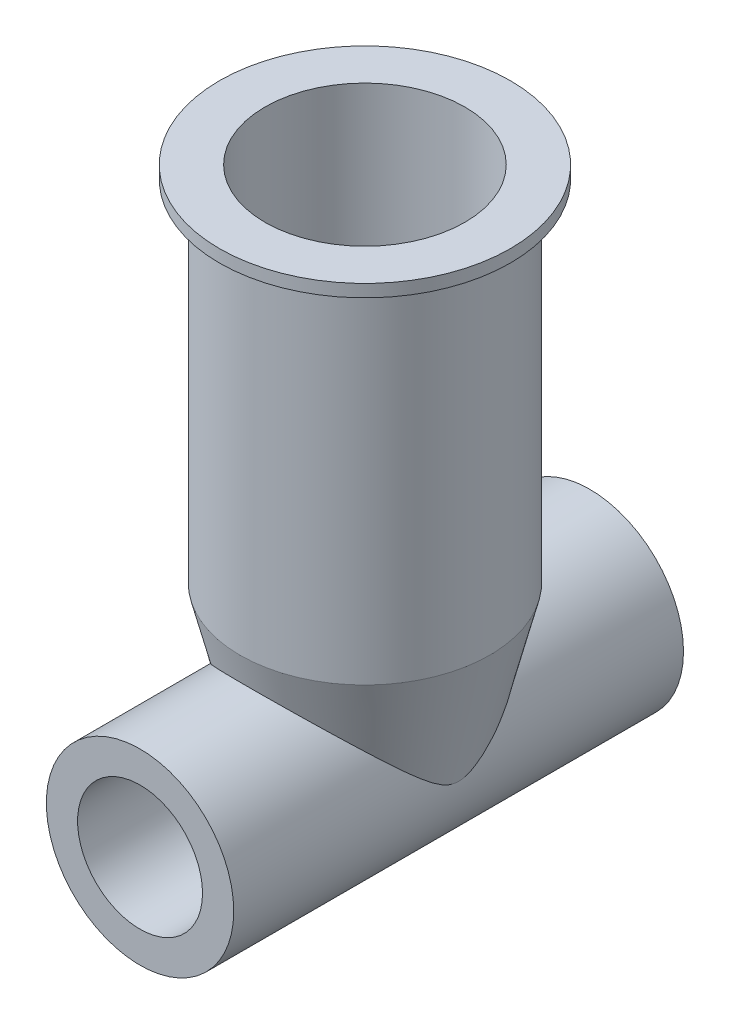
ISO-10303-21;
HEADER;
FILE_DESCRIPTION(('STEP AP214'),'2;1');
FILE_NAME('part.step','',(''),(''),'','','');
FILE_SCHEMA(('AUTOMOTIVE_DESIGN { 1 0 10303 214 1 1 1 1 }'));
ENDSEC;
DATA;
#1=APPLICATION_CONTEXT('core data for automotive mechanical design processes');
#2=APPLICATION_PROTOCOL_DEFINITION('international standard','automotive_design',2000,#1);
#3=PRODUCT_CONTEXT('',#1,'mechanical');
#4=PRODUCT('Part','Part','',(#3));
#5=PRODUCT_RELATED_PRODUCT_CATEGORY('part','',(#4));
#6=PRODUCT_DEFINITION_FORMATION('','',#4);
#7=PRODUCT_DEFINITION_CONTEXT('part definition',#1,'design');
#8=PRODUCT_DEFINITION('design','',#6,#7);
#9=PRODUCT_DEFINITION_SHAPE('','',#8);
#10=(LENGTH_UNIT() NAMED_UNIT(*) SI_UNIT(.MILLI.,.METRE.));
#11=(NAMED_UNIT(*) PLANE_ANGLE_UNIT() SI_UNIT($,.RADIAN.));
#12=(NAMED_UNIT(*) SI_UNIT($,.STERADIAN.) SOLID_ANGLE_UNIT());
#13=UNCERTAINTY_MEASURE_WITH_UNIT(LENGTH_MEASURE(1.E-05),#10,'distance_accuracy_value','');
#14=(GEOMETRIC_REPRESENTATION_CONTEXT(3) GLOBAL_UNCERTAINTY_ASSIGNED_CONTEXT((#13)) GLOBAL_UNIT_ASSIGNED_CONTEXT((#10,
#11,#12)) REPRESENTATION_CONTEXT('',''));
#15=CARTESIAN_POINT('',(0.,0.,0.));
#16=DIRECTION('',(0.,0.,1.));
#17=DIRECTION('',(1.,0.,0.));
#18=AXIS2_PLACEMENT_3D('',#15,#16,#17);
#19=CARTESIAN_POINT('',(0.,0.,-18.));
#20=DIRECTION('',(0.,0.,1.));
#21=DIRECTION('',(1.,0.,0.));
#22=AXIS2_PLACEMENT_3D('',#19,#20,#21);
#23=CYLINDRICAL_SURFACE('',#22,7.5);
#24=CARTESIAN_POINT('',(0.,0.,0.));
#25=DIRECTION('',(0.,1.,0.));
#26=DIRECTION('',(0.,0.,1.));
#27=AXIS2_PLACEMENT_3D('',#24,#25,#26);
#28=CIRCLE('',#27,7.5);
#29=CARTESIAN_POINT('',(7.5,7.9539344722326E-08,0.000546143343571179));
#30=VERTEX_POINT('',#29);
#31=CARTESIAN_POINT('',(7.5,0.,0.));
#32=VERTEX_POINT('',#31);
#33=EDGE_CURVE('E66',#30,#32,#28,.T.);
#34=ORIENTED_EDGE('',*,*,#33,.F.);
#35=CARTESIAN_POINT('',(-6.61320157659944,3.53773443142114,-5.15405586230843));
#36=CARTESIAN_POINT('',(-6.74809705513501,3.28556143948497,-4.8784253702715));
#37=CARTESIAN_POINT('',(-6.8660531232813,3.03036321266984,-4.59711082388532));
#38=CARTESIAN_POINT('',(-7.01894883888934,2.64639385705199,-4.16750919903163));
#39=CARTESIAN_POINT('',(-7.06593813689447,2.51809634764333,-4.02290759225156));
#40=CARTESIAN_POINT('',(-7.15209296283975,2.26181909678305,-3.73111922999439));
#41=CARTESIAN_POINT('',(-7.19125941511541,2.13383931955556,-3.58393278217669));
#42=CARTESIAN_POINT('',(-7.26190321000422,1.87940005449735,-3.28716729121952));
#43=CARTESIAN_POINT('',(-7.2934013995853,1.75293735392403,-3.13759594000608));
#44=CARTESIAN_POINT('',(-7.34911880374787,1.50230489314478,-2.83510919196657));
#45=CARTESIAN_POINT('',(-7.3733355415806,1.37813592658939,-2.68219267622999));
#46=CARTESIAN_POINT('',(-7.41475947365553,1.13428241571495,-2.37249809885837));
#47=CARTESIAN_POINT('',(-7.43198344577408,1.01458777073297,-2.21573024873793));
#48=CARTESIAN_POINT('',(-7.4599774546505,0.782493390251813,-1.89638027254089));
#49=CARTESIAN_POINT('',(-7.4707527208265,0.670087810008142,-1.73380297118948));
#50=CARTESIAN_POINT('',(-7.4818052886037,0.523718330581862,-1.50255840646446));
#51=CARTESIAN_POINT('',(-7.48446301403202,0.484034979380131,-1.43764071102675));
#52=CARTESIAN_POINT('',(-7.48903205995686,0.407281613949371,-1.30625661753596));
#53=CARTESIAN_POINT('',(-7.49094329907509,0.370211885005457,-1.23979005146906));
#54=CARTESIAN_POINT('',(-7.49568135899195,0.264035803329959,-1.03782910282829));
#55=CARTESIAN_POINT('',(-7.49752167839577,0.199830035216777,-0.89957242662149));
#56=CARTESIAN_POINT('',(-7.49938231082716,0.105091899765061,-0.645277813189461));
#57=CARTESIAN_POINT('',(-7.4997099464473,0.0702812965857011,-0.530893443775187));
#58=CARTESIAN_POINT('',(-7.50001725106025,0.0201826111539165,-0.29806703473363));
#59=CARTESIAN_POINT('',(-7.49999814567919,0.0048259708462501,-0.179640763532988));
#60=CARTESIAN_POINT('',(-7.50000173587526,-0.00287805927304035,0.0587550198297938));
#61=CARTESIAN_POINT('',(-7.5000246929406,0.00491867489089359,0.178729550434703));
#62=CARTESIAN_POINT('',(-7.49990239520932,0.0418470345207006,0.415465244548114));
#63=CARTESIAN_POINT('',(-7.49975664542932,0.0710413477875864,0.532215918110214));
#64=CARTESIAN_POINT('',(-7.4986816277319,0.145405075332991,0.761278245424615));
#65=CARTESIAN_POINT('',(-7.4977460600945,0.190701233909167,0.873546584416198));
#66=CARTESIAN_POINT('',(-7.4944843241405,0.292028629592736,1.09319345839956));
#67=CARTESIAN_POINT('',(-7.49215568678609,0.348078806721073,1.20056294628575));
#68=CARTESIAN_POINT('',(-7.48564376072543,0.467717745065244,1.41202078729599));
#69=CARTESIAN_POINT('',(-7.4814457679568,0.531363285789262,1.51607597599339));
#70=CARTESIAN_POINT('',(-7.47089404107053,0.663431366597112,1.72085390612633));
#71=CARTESIAN_POINT('',(-7.46454181817174,0.731850531273435,1.82157892949855));
#72=CARTESIAN_POINT('',(-7.44518393231739,0.91182113662772,2.07708963955048));
#73=CARTESIAN_POINT('',(-7.43044886572856,1.02577539036855,2.23004594777763));
#74=CARTESIAN_POINT('',(-7.3946280157267,1.25832081989527,2.53166440412867));
#75=CARTESIAN_POINT('',(-7.37353986735014,1.37691370810363,2.6803249305044));
#76=CARTESIAN_POINT('',(-7.32465150363509,1.61694174044912,2.97452117375761));
#77=CARTESIAN_POINT('',(-7.29684298051375,1.73838023323266,3.1200527782437));
#78=CARTESIAN_POINT('',(-7.23427470816608,1.98272427248463,3.40837093600875));
#79=CARTESIAN_POINT('',(-7.19951423734498,2.10562996999893,3.55115720264068));
#80=CARTESIAN_POINT('',(-7.08470334690888,2.4744911954719,3.97503506055283));
#81=CARTESIAN_POINT('',(-6.9939756311839,2.72134176320794,4.25254668889251));
#82=CARTESIAN_POINT('',(-6.78249998735241,3.21235180731754,4.79797630725139));
#83=CARTESIAN_POINT('',(-6.66177690617969,3.45651333722966,5.06590202874486));
#84=CARTESIAN_POINT('',(-6.42386288123573,3.87636784824739,5.523193971319));
#85=CARTESIAN_POINT('',(-6.31380220548549,4.05346771888293,5.71498849519644));
#86=CARTESIAN_POINT('',(-6.0754112695079,4.40273648235033,6.09171014745804));
#87=CARTESIAN_POINT('',(-5.947078996211,4.57490482933867,6.27663651631027));
#88=CARTESIAN_POINT('',(-5.67148485930783,4.912401108886,6.63805780408488));
#89=CARTESIAN_POINT('',(-5.52424194898409,5.07773567425567,6.81456092555652));
#90=CARTESIAN_POINT('',(-5.20993787515479,5.3997346081586,7.15753616509969));
#91=CARTESIAN_POINT('',(-5.04288385713021,5.5564020730277,7.32401186739506));
#92=CARTESIAN_POINT('',(-4.73775189297959,5.81652150009949,7.59994180501488));
#93=CARTESIAN_POINT('',(-4.60459149277175,5.9226263841102,7.71234738941338));
#94=CARTESIAN_POINT('',(-4.32736984992019,6.12810249724339,7.92980039607749));
#95=CARTESIAN_POINT('',(-4.18330572383073,6.22747193194216,8.03484585774634));
#96=CARTESIAN_POINT('',(-3.88442784786883,6.41814687652538,8.2362418687826));
#97=CARTESIAN_POINT('',(-3.72962546197995,6.50946068571808,8.33260136914614));
#98=CARTESIAN_POINT('',(-3.40937845998663,6.68275759008583,8.51534877456879));
#99=CARTESIAN_POINT('',(-3.2439407708331,6.76474666414716,8.60174306968464));
#100=CARTESIAN_POINT('',(-2.93667571655216,6.90278245883528,8.74711614841249));
#101=CARTESIAN_POINT('',(-2.79667304984499,6.96074932269721,8.80813396905946));
#102=CARTESIAN_POINT('',(-2.51056843655749,7.06897582850668,8.92201551398301));
#103=CARTESIAN_POINT('',(-2.36446953402664,7.11923925979972,8.97488324739163));
#104=CARTESIAN_POINT('',(-2.0667700695,7.21129163012331,9.07167749082905));
#105=CARTESIAN_POINT('',(-1.91517091517014,7.25308271967268,9.11560626982669));
#106=CARTESIAN_POINT('',(-1.60727000317382,7.3274663089743,9.19377802662676));
#107=CARTESIAN_POINT('',(-1.45096820010294,7.36005871988108,9.22802091087796));
#108=CARTESIAN_POINT('',(-1.13367242697758,7.41558454546461,9.28635014287708));
#109=CARTESIAN_POINT('',(-0.972654190443076,7.43845238057259,9.31036753426766));
#110=CARTESIAN_POINT('',(-0.648212333756121,7.47371686842531,9.34740190798296));
#111=CARTESIAN_POINT('',(-0.484788707991197,7.48611349673372,9.36041886463631));
#112=CARTESIAN_POINT('',(-0.157016478848424,7.50014975035415,9.37515734345321));
#113=CARTESIAN_POINT('',(0.00733184862007326,7.50179243002074,9.37688207285416));
#114=CARTESIAN_POINT('',(0.335500621563336,7.49428925480907,9.36900367983671));
#115=CARTESIAN_POINT('',(0.499321105595518,7.48514420671922,9.35940140453796));
#116=CARTESIAN_POINT('',(0.807899599863817,7.45779608755527,9.33068242408866));
#117=CARTESIAN_POINT('',(0.952856240911138,7.44064264395448,9.31266819487775));
#118=CARTESIAN_POINT('',(1.24027342435016,7.39816398840857,9.26805080109966));
#119=CARTESIAN_POINT('',(1.3827331317569,7.37283609586017,9.24144481908338));
#120=CARTESIAN_POINT('',(1.66421544718924,7.31444085938264,9.18008980881214));
#121=CARTESIAN_POINT('',(1.80323902981614,7.28137573850357,9.14534311953073));
#122=CARTESIAN_POINT('',(2.07724086407488,7.20799539344709,9.06821025499059));
#123=CARTESIAN_POINT('',(2.21221749632084,7.16767731100473,9.02582106794282));
#124=CARTESIAN_POINT('',(2.48475606397905,7.07797105048914,8.93147595233143));
#125=CARTESIAN_POINT('',(2.62205734792646,7.02820806198673,8.87912428364017));
#126=CARTESIAN_POINT('',(2.89102789612641,6.92191348233042,8.76725412320456));
#127=CARTESIAN_POINT('',(3.02269531866239,6.86537970039556,8.70773331175231));
#128=CARTESIAN_POINT('',(3.40867582271751,6.68665050855163,8.51946933399201));
#129=CARTESIAN_POINT('',(3.65405726107538,6.5552968910782,8.38099271716159));
#130=CARTESIAN_POINT('',(4.25474428543344,6.19130494165446,7.99675078622709));
#131=CARTESIAN_POINT('',(4.59127523167133,5.94410425085349,7.73533677768344));
#132=CARTESIAN_POINT('',(5.04963410087188,5.54906777556111,7.31619840867083));
#133=CARTESIAN_POINT('',(5.1949018914058,5.41308088302144,7.17169590939528));
#134=CARTESIAN_POINT('',(5.47047380646926,5.13441935288831,6.87498067520199));
#135=CARTESIAN_POINT('',(5.60077831667004,4.9917448877973,6.72276813915249));
#136=CARTESIAN_POINT('',(5.89762444833259,4.64116340296421,6.34779408726627));
#137=CARTESIAN_POINT('',(6.05696666341839,4.43060656862025,6.12181180216102));
#138=CARTESIAN_POINT('',(6.34830614170618,4.00202093621475,5.65945461340801));
#139=CARTESIAN_POINT('',(6.480289995191,3.78398853472905,5.42307468183144));
#140=CARTESIAN_POINT('',(6.71813841520673,3.3435276940099,4.94191215860279));
#141=CARTESIAN_POINT('',(6.82402470107441,3.1211030778081,4.6971367485779));
#142=CARTESIAN_POINT('',(7.01104407066185,2.67466021036397,4.19997099780755));
#143=CARTESIAN_POINT('',(7.09218721923862,2.45064264513986,3.94758379937051));
#144=CARTESIAN_POINT('',(7.2292617228321,2.0098664487858,3.44115496423444));
#145=CARTESIAN_POINT('',(7.28576305407534,1.7930646147689,3.18730601331283));
#146=CARTESIAN_POINT('',(7.35468733078022,1.4732734417243,2.79919745637144));
#147=CARTESIAN_POINT('',(7.37502874408378,1.36754007947056,2.66855556850512));
#148=CARTESIAN_POINT('',(7.41064130490838,1.15911012714994,2.40419864939725));
#149=CARTESIAN_POINT('',(7.42591328932815,1.05641303838519,2.27048412930954));
#150=CARTESIAN_POINT('',(7.44799937990368,0.884604107371846,2.03779893199928));
#151=CARTESIAN_POINT('',(7.45598324564902,0.814287670863766,1.93982978289773));
#152=CARTESIAN_POINT('',(7.46967523172035,0.677261543587757,1.74125471533403));
#153=CARTESIAN_POINT('',(7.47538382778066,0.61055110136948,1.64064935276901));
#154=CARTESIAN_POINT('',(7.4847429524897,0.482429564495188,1.43613868618992));
#155=CARTESIAN_POINT('',(7.48839573142874,0.421012738094866,1.33223712235182));
#156=CARTESIAN_POINT('',(7.4939744987758,0.306023918371719,1.12018894327783));
#157=CARTESIAN_POINT('',(7.49590223226956,0.252444043074283,1.01204673385082));
#158=CARTESIAN_POINT('',(7.4985404667777,0.155832272538358,0.787727052841384));
#159=CARTESIAN_POINT('',(7.49921930359724,0.113097851706791,0.671416231520167));
#160=CARTESIAN_POINT('',(7.49993498962478,0.0461821634360362,0.43382452238483));
#161=CARTESIAN_POINT('',(7.49997469760318,0.0219187415643125,0.312568199804991));
#162=CARTESIAN_POINT('',(7.50001323970137,-0.00286317138587129,0.065983679835985));
#163=CARTESIAN_POINT('',(7.50001158064303,-0.00309498939990635,-0.0593758344507875));
#164=CARTESIAN_POINT('',(7.4999776970929,0.0210248800977522,-0.307797707649985));
#165=CARTESIAN_POINT('',(7.4999453975218,0.045436962679633,-0.430853666623425));
#166=CARTESIAN_POINT('',(7.49906246233558,0.127428640151383,-0.722762457647414));
#167=CARTESIAN_POINT('',(7.49786843698408,0.194717384946164,-0.888745172879665));
#168=CARTESIAN_POINT('',(7.49363127375126,0.31156882529719,-1.12975893510011));
#169=CARTESIAN_POINT('',(7.49180152143674,0.353329481331196,-1.20900734842534));
#170=CARTESIAN_POINT('',(7.48715840158507,0.440874289748779,-1.36523242116752));
#171=CARTESIAN_POINT('',(7.48434530198961,0.486657343571108,-1.44220969323361));
#172=CARTESIAN_POINT('',(7.47482610581218,0.619995511502793,-1.65673994042623));
#173=CARTESIAN_POINT('',(7.46682053112449,0.710961587882499,-1.79209196554467));
#174=CARTESIAN_POINT('',(7.44655584148733,0.898760504912508,-2.05837179288817));
#175=CARTESIAN_POINT('',(7.43429434116563,0.995596610437243,-2.18929706874104));
#176=CARTESIAN_POINT('',(7.40516786736286,1.1930928136378,-2.44804372794407));
#177=CARTESIAN_POINT('',(7.388295242061,1.29375902594607,-2.5758595640403));
#178=CARTESIAN_POINT('',(7.34972874138128,1.49741440064896,-2.82889439392082));
#179=CARTESIAN_POINT('',(7.3280342601001,1.60040385351401,-2.95411305918674));
#180=CARTESIAN_POINT('',(7.25538207138687,1.91175845045548,-3.32694299807635));
#181=CARTESIAN_POINT('',(7.1968946544851,2.12223221364878,-3.57137491384953));
#182=CARTESIAN_POINT('',(7.05884692043525,2.54401166812226,-4.05302840825562));
#183=CARTESIAN_POINT('',(6.97930624824294,2.75531640386851,-4.29025647999982));
#184=CARTESIAN_POINT('',(6.7981828670867,3.17602355428345,-4.75765173133414));
#185=CARTESIAN_POINT('',(6.69661404805207,3.38542708146919,-4.98782325654145));
#186=CARTESIAN_POINT('',(6.4702982035219,3.80014330549305,-5.44056233390496));
#187=CARTESIAN_POINT('',(6.34554246290292,4.00545443191195,-5.6631269895528));
#188=CARTESIAN_POINT('',(6.07200197259719,4.40909193196314,-6.09863202905522));
#189=CARTESIAN_POINT('',(5.92327261958574,4.60743315419886,-6.31159318597011));
#190=CARTESIAN_POINT('',(5.60044693545729,4.99485238730104,-6.72618930107918));
#191=CARTESIAN_POINT('',(5.42636500061718,5.18393557439158,-6.92783059773711));
#192=CARTESIAN_POINT('',(4.99589107093401,5.60414145108378,-7.37487204782033));
#193=CARTESIAN_POINT('',(4.73038913562713,5.83113615513201,-7.61555244722222));
#194=CARTESIAN_POINT('',(4.15272549169959,6.25564484566077,-8.06474648798324));
#195=CARTESIAN_POINT('',(3.84062459310654,6.4531965926048,-8.27330134193865));
#196=CARTESIAN_POINT('',(3.23355518701435,6.77409561537892,-8.61163533329006));
#197=CARTESIAN_POINT('',(2.94653184972578,6.90441060575172,-8.74885324872024));
#198=CARTESIAN_POINT('',(2.49582843913602,7.07437011379257,-8.9276907298525));
#199=CARTESIAN_POINT('',(2.3421840080253,7.12678287648573,-8.98281733347559));
#200=CARTESIAN_POINT('',(2.02889118002014,7.22221366464538,-9.08315986550921));
#201=CARTESIAN_POINT('',(1.86924562083046,7.26523606654736,-9.12838041073518));
#202=CARTESIAN_POINT('',(1.54345029081211,7.34138944652658,-9.20840759961474));
#203=CARTESIAN_POINT('',(1.37725513467864,7.37442856523832,-9.24311753771449));
#204=CARTESIAN_POINT('',(1.04100943451957,7.42935461587368,-9.30081327835943));
#205=CARTESIAN_POINT('',(0.870958873080595,7.45124149741644,-9.32379902793994));
#206=CARTESIAN_POINT('',(0.528655012503762,7.48331845690636,-9.35748433992442));
#207=CARTESIAN_POINT('',(0.356403191369269,7.49351600508613,-9.36819174897593));
#208=CARTESIAN_POINT('',(0.0112942944847741,7.50197660308043,-9.37707546792193));
#209=CARTESIAN_POINT('',(-0.161562701673201,7.50024116742709,-9.37525336805939));
#210=CARTESIAN_POINT('',(-0.482402912829425,7.48594803255162,-9.36024509177485));
#211=CARTESIAN_POINT('',(-0.630533796397303,7.47491339525391,-9.34865822469375));
#212=CARTESIAN_POINT('',(-0.924951572246102,7.44421745300976,-9.31642215844064));
#213=CARTESIAN_POINT('',(-1.07123786110365,7.42455339676253,-9.29577006902096));
#214=CARTESIAN_POINT('',(-1.36088539666958,7.37695924425815,-9.24577570804026));
#215=CARTESIAN_POINT('',(-1.50424767165405,7.34903210935145,-9.21643654977803));
#216=CARTESIAN_POINT('',(-1.78732027656718,7.28536505788948,-9.14953491869948));
#217=CARTESIAN_POINT('',(-1.92702912207055,7.24962201922286,-9.11196915970748));
#218=CARTESIAN_POINT('',(-2.20459002851406,7.17014670742452,-9.02841682667735));
#219=CARTESIAN_POINT('',(-2.34236029572798,7.12627922009478,-8.98228769733907));
#220=CARTESIAN_POINT('',(-2.61281041958519,7.03162610491209,-8.88271904290482));
#221=CARTESIAN_POINT('',(-2.74548864997567,6.98083829008255,-8.8292772068091));
#222=CARTESIAN_POINT('',(-3.13523132435222,6.81904825860703,-8.65896042048274));
#223=CARTESIAN_POINT('',(-3.3840624469812,6.69860223555828,-8.53207610298698));
#224=CARTESIAN_POINT('',(-3.9855987991564,6.36697845346649,-8.18231448225325));
#225=CARTESIAN_POINT('',(-4.32202264213911,6.14188335962317,-7.94455427446802));
#226=CARTESIAN_POINT('',(-4.78373083543405,5.77965473942041,-7.56086978248833));
#227=CARTESIAN_POINT('',(-4.93063258837747,5.65464584026388,-7.42828843060904));
#228=CARTESIAN_POINT('',(-5.21061060828153,5.39773790460035,-7.15535870176559));
#229=CARTESIAN_POINT('',(-5.34368887123174,5.26583986696872,-7.01501145062646));
#230=CARTESIAN_POINT('',(-5.58756100729743,5.00586587970365,-6.73780588564317));
#231=CARTESIAN_POINT('',(-5.69926169096202,4.87816467316271,-6.60138662092604));
#232=CARTESIAN_POINT('',(-5.91140265689726,4.61880712852137,-6.32365850486234));
#233=CARTESIAN_POINT('',(-6.01184309898232,4.48715084658821,-6.18234972294899));
#234=CARTESIAN_POINT('',(-6.2019049592746,4.2205674757013,-5.89536811658318));
#235=CARTESIAN_POINT('',(-6.29151802426664,4.08563795662716,-5.74969202957656));
#236=CARTESIAN_POINT('',(-6.46018513597841,3.81335353158669,-5.45459874933216));
#237=CARTESIAN_POINT('',(-6.5392395482,3.67599870976192,-5.305181685806));
#238=CARTESIAN_POINT('',(-6.61320157659944,3.53773443142114,-5.15405586230843));
#239=B_SPLINE_CURVE_WITH_KNOTS('',3,(#35,#36,#37,#38,#39,#40,#41,#42,#43,#44,#45,#46,#47,#48,
#49,#50,#51,#52,#53,#54,#55,#56,#57,#58,#59,#60,#61,#62,#63,#64,#65,#66,#67,#68,#69,#70,#71,#72,
#73,#74,#75,#76,#77,#78,#79,#80,#81,#82,#83,#84,#85,#86,#87,#88,#89,#90,#91,#92,#93,#94,#95,#96,
#97,#98,#99,#100,#101,#102,#103,#104,#105,#106,#107,#108,#109,#110,#111,#112,#113,#114,#115,
#116,#117,#118,#119,#120,#121,#122,#123,#124,#125,#126,#127,#128,#129,#130,#131,#132,#133,#134,
#135,#136,#137,#138,#139,#140,#141,#142,#143,#144,#145,#146,#147,#148,#149,#150,#151,#152,#153,
#154,#155,#156,#157,#158,#159,#160,#161,#162,#163,#164,#165,#166,#167,#168,#169,#170,#171,#172,
#173,#174,#175,#176,#177,#178,#179,#180,#181,#182,#183,#184,#185,#186,#187,#188,#189,#190,#191,
#192,#193,#194,#195,#196,#197,#198,#199,#200,#201,#202,#203,#204,#205,#206,#207,#208,#209,#210,
#211,#212,#213,#214,#215,#216,#217,#218,#219,#220,#221,#222,#223,#224,#225,#226,#227,#228,#229,
#230,#231,#232,#233,#234,#235,#236,#237,#238),.UNSPECIFIED.,.T.,.F.,(4,2,2,2,2,2,2,2,2,2,2,2,2,
2,2,2,2,2,2,2,2,2,2,2,2,2,2,2,2,2,2,2,2,2,2,2,2,2,2,2,2,2,2,2,2,2,2,2,2,2,2,2,2,2,2,2,2,2,2,2,2,
2,2,2,2,2,2,2,2,2,2,2,2,2,2,2,2,2,2,2,2,2,2,2,2,2,2,2,2,2,2,2,2,2,2,2,2,2,2,2,2,4),(0.,
1.19132542337807,1.78802969955181,2.38466342829518,2.9796565649532,3.57485185714447,
4.16861052417499,4.76188704261482,4.99022332808864,5.21858449872602,5.6745860600396,
6.03206318323956,6.38827697818143,6.74671275345619,7.10620284532076,7.46858768098818,
7.83161670821645,8.19755314064189,8.56323339337683,9.13685921363278,9.71069883311201,
10.2852514996431,10.8598638342832,12.0055519277651,13.1502941257752,13.9995808747269,
14.8489612661851,15.6974969098626,16.5457274287751,17.1573251621411,17.7690851989526,
18.3802074243842,18.9909355711981,19.4805397868239,19.9699023860423,20.4591406153065,
20.948383569718,21.4408754293037,21.9333684381991,22.425721562331,22.9180378668822,
23.3587636288949,23.7996340628424,24.2403779816863,24.681295971996,25.1462671082186,
25.611389100617,26.5413349663039,28.0105660168285,28.7478613950645,29.4851377656043,
30.5262827417764,31.5679368353292,32.6087210771431,33.649081388819,34.6639041936765,
35.171692638479,35.6793972120773,36.0418866711431,36.4043002977675,36.7663164522948,
37.1279659696699,37.498664584606,37.86770463222,38.2411464590213,38.6155057108351,
39.1496450636167,39.4184154027251,39.6871125645211,40.1766049183435,40.6663720683119,
41.1569569379932,41.6476034883259,42.6302467473848,43.6119763072056,44.5930886243343,
45.5745704545288,46.5538160222271,47.532507685105,48.8009615964655,50.0677744575897,
51.0947250396428,51.608505162112,52.1220453204657,52.6401761198827,53.1583092599639,
53.6761110948602,54.1938472116559,54.6402942662682,55.0868837642538,55.5333134054261,
55.9799217025228,56.4347685730418,56.8897595200585,57.799551896325,59.1996053471934,
59.9013544338511,60.6030020528919,61.2557270079069,61.9084426977506,62.5616587787785,
63.2148522419947),.UNSPECIFIED.);
#240=CARTESIAN_POINT('',(-7.5,0.,0.));
#241=VERTEX_POINT('',#240);
#242=EDGE_CURVE('E71',#241,#30,#239,.T.);
#243=ORIENTED_EDGE('',*,*,#242,.F.);
#244=CARTESIAN_POINT('',(-7.50000000006988,0.,-0.000546147915184217));
#245=VERTEX_POINT('',#244);
#246=EDGE_CURVE('E112',#245,#241,#28,.T.);
#247=ORIENTED_EDGE('',*,*,#246,.F.);
#248=EDGE_CURVE('E186',#32,#245,#239,.T.);
#249=ORIENTED_EDGE('',*,*,#248,.F.);
#250=EDGE_LOOP('',(#34,#243,#247,#249));
#251=FACE_BOUND('',#250,.T.);
#252=CARTESIAN_POINT('',(0.,0.,-18.));
#253=DIRECTION('',(0.,0.,1.));
#254=DIRECTION('',(1.,0.,0.));
#255=AXIS2_PLACEMENT_3D('',#252,#253,#254);
#256=CIRCLE('',#255,7.5);
#257=CARTESIAN_POINT('',(7.5,0.,-18.));
#258=VERTEX_POINT('',#257);
#259=EDGE_CURVE('E169',#258,#258,#256,.T.);
#260=ORIENTED_EDGE('',*,*,#259,.T.);
#261=EDGE_LOOP('',(#260));
#262=FACE_BOUND('',#261,.T.);
#263=CARTESIAN_POINT('',(0.,0.,18.));
#264=DIRECTION('',(0.,0.,1.));
#265=DIRECTION('',(1.,0.,0.));
#266=AXIS2_PLACEMENT_3D('',#263,#264,#265);
#267=CIRCLE('',#266,7.5);
#268=CARTESIAN_POINT('',(7.5,0.,18.));
#269=VERTEX_POINT('',#268);
#270=EDGE_CURVE('E177',#269,#269,#267,.T.);
#271=ORIENTED_EDGE('',*,*,#270,.F.);
#272=EDGE_LOOP('',(#271));
#273=FACE_BOUND('',#272,.T.);
#274=ADVANCED_FACE('F47',(#251,#262,#273),#23,.T.);
#275=CARTESIAN_POINT('',(0.,0.,-18.));
#276=DIRECTION('',(0.,0.,1.));
#277=DIRECTION('',(1.,0.,0.));
#278=AXIS2_PLACEMENT_3D('',#275,#276,#277);
#279=PLANE('',#278);
#280=CARTESIAN_POINT('',(0.,0.,-18.));
#281=DIRECTION('',(0.,0.,1.));
#282=DIRECTION('',(1.,0.,0.));
#283=AXIS2_PLACEMENT_3D('',#280,#281,#282);
#284=CIRCLE('',#283,5.);
#285=CARTESIAN_POINT('',(5.,0.,-18.));
#286=VERTEX_POINT('',#285);
#287=EDGE_CURVE('E173',#286,#286,#284,.T.);
#288=ORIENTED_EDGE('',*,*,#287,.T.);
#289=EDGE_LOOP('',(#288));
#290=FACE_BOUND('',#289,.T.);
#291=ORIENTED_EDGE('',*,*,#259,.F.);
#292=EDGE_LOOP('',(#291));
#293=FACE_BOUND('',#292,.T.);
#294=ADVANCED_FACE('F250',(#290,#293),#279,.F.);
#295=CARTESIAN_POINT('',(0.,0.,-18.));
#296=DIRECTION('',(0.,0.,1.));
#297=DIRECTION('',(1.,0.,0.));
#298=AXIS2_PLACEMENT_3D('',#295,#296,#297);
#299=CYLINDRICAL_SURFACE('',#298,5.);
#300=DIRECTION('',(0.,0.,1.));
#301=VECTOR('',#300,1.);
#302=CARTESIAN_POINT('',(-5.,0.,-18.));
#303=LINE('',#302,#301);
#304=CARTESIAN_POINT('',(-4.99999912611511,0.,5.59016896676148));
#305=VERTEX_POINT('',#304);
#306=CARTESIAN_POINT('',(-5.,0.,-5.59016994374948));
#307=VERTEX_POINT('',#306);
#308=EDGE_CURVE('E105',#305,#307,#303,.F.);
#309=ORIENTED_EDGE('',*,*,#308,.F.);
#310=CARTESIAN_POINT('',(-4.999999991,-0.000300000000051373,5.59006932833796));
#311=CARTESIAN_POINT('',(-4.99999625078052,0.14861613655285,5.64000636995396));
#312=CARTESIAN_POINT('',(-4.99336684752314,0.295655390755422,5.6949767529882));
#313=CARTESIAN_POINT('',(-4.96777027896964,0.585109688169422,5.81284533995285));
#314=CARTESIAN_POINT('',(-4.94882731025358,0.727533226399339,5.87572780135994));
#315=CARTESIAN_POINT('',(-4.89967756406789,1.0065234698099,6.0070459429693));
#316=CARTESIAN_POINT('',(-4.86954812805474,1.14312337209917,6.07544102499158));
#317=CARTESIAN_POINT('',(-4.79868144035083,1.41135055079468,6.2164963741202));
#318=CARTESIAN_POINT('',(-4.75793835569043,1.54297504716363,6.28915896947346));
#319=CARTESIAN_POINT('',(-4.66673707836849,1.8000018054483,6.436652920172));
#320=CARTESIAN_POINT('',(-4.61636026501638,1.92544583701207,6.51146193672415));
#321=CARTESIAN_POINT('',(-4.5060321417267,2.17113283093887,6.66257195964963));
#322=CARTESIAN_POINT('',(-4.44607707415471,2.29137372844079,6.73887354121727));
#323=CARTESIAN_POINT('',(-4.25174054125155,2.64484088350359,6.96884866925895));
#324=CARTESIAN_POINT('',(-4.10313665624869,2.87011528909386,7.12318157016034));
#325=CARTESIAN_POINT('',(-3.83666962233839,3.21029827039854,7.36408777816432));
#326=CARTESIAN_POINT('',(-3.7305837508684,3.33307273064887,7.45288330552724));
#327=CARTESIAN_POINT('',(-3.50530289469857,3.56924169658289,7.62647093062127));
#328=CARTESIAN_POINT('',(-3.38610480978666,3.68263397281919,7.71126207476543));
#329=CARTESIAN_POINT('',(-3.13506922986546,3.89854597681482,7.87479843204888));
#330=CARTESIAN_POINT('',(-3.00326565353659,4.00109340081439,7.95355889723772));
#331=CARTESIAN_POINT('',(-2.72718829368475,4.19414286949755,8.10333333459568));
#332=CARTESIAN_POINT('',(-2.58292206469568,4.28465212805557,8.17435194143058));
#333=CARTESIAN_POINT('',(-2.23340569850133,4.47925295187186,8.32823468861774));
#334=CARTESIAN_POINT('',(-2.02356216969618,4.57821494400763,8.40745958614282));
#335=CARTESIAN_POINT('',(-1.69559248512247,4.70518508557828,8.509768232544));
#336=CARTESIAN_POINT('',(-1.5840481490741,4.74393448808096,8.54112031201601));
#337=CARTESIAN_POINT('',(-1.35710793052745,4.81376402879603,8.59777375609998));
#338=CARTESIAN_POINT('',(-1.24171391234602,4.84484781980466,8.62307800243087));
#339=CARTESIAN_POINT('',(-1.00696588481376,4.89904462432115,8.66728342468689));
#340=CARTESIAN_POINT('',(-0.887589499551137,4.92209919889736,8.68613763855779));
#341=CARTESIAN_POINT('',(-0.646631295742456,4.95950828965736,8.7167675250192));
#342=CARTESIAN_POINT('',(-0.525050488910506,4.97386669779173,8.72854636415908));
#343=CARTESIAN_POINT('',(-0.280685082876351,4.99361995608659,8.74475797408144));
#344=CARTESIAN_POINT('',(-0.157900604055737,4.99901569360465,8.74919147209617));
#345=CARTESIAN_POINT('',(0.0877678146439325,5.00073837297104,8.75060651183288));
#346=CARTESIAN_POINT('',(0.21065174562371,4.99706605219283,8.74758865946495));
#347=CARTESIAN_POINT('',(0.442878390349423,4.98156391798311,8.73486244207573));
#348=CARTESIAN_POINT('',(0.552319932353168,4.97060737212993,8.72587036512361));
#349=CARTESIAN_POINT('',(0.769641470642178,4.9416284030003,8.70212328033539));
#350=CARTESIAN_POINT('',(0.877520964569314,4.9236037567399,8.68736645943873));
#351=CARTESIAN_POINT('',(1.19766695021813,4.85930501043065,8.63483014927849));
#352=CARTESIAN_POINT('',(1.40664211787726,4.80279204822496,8.58877311558073));
#353=CARTESIAN_POINT('',(1.81683893336848,4.66342241662504,8.47599760586056));
#354=CARTESIAN_POINT('',(2.017648154563,4.579835685882,8.40870805887428));
#355=CARTESIAN_POINT('',(2.40188004447464,4.39054727993355,8.25787162819566));
#356=CARTESIAN_POINT('',(2.58529438060846,4.28483508305638,8.17431701104469));
#357=CARTESIAN_POINT('',(3.00993228548885,4.00382362307546,7.95514232520213));
#358=CARTESIAN_POINT('',(3.24105918200152,3.8183773022365,7.81279454815997));
#359=CARTESIAN_POINT('',(3.55702118966883,3.51694887052359,7.58784813499404));
#360=CARTESIAN_POINT('',(3.6573654823398,3.41239759575084,7.51082043875111));
#361=CARTESIAN_POINT('',(3.84776531308402,3.19615835452925,7.35412976657362));
#362=CARTESIAN_POINT('',(3.93782172588797,3.08447099608951,7.27446701542939));
#363=CARTESIAN_POINT('',(4.19502031322255,2.73606204054839,7.03083821311159));
#364=CARTESIAN_POINT('',(4.34618537862275,2.48888411790613,6.86443227334468));
#365=CARTESIAN_POINT('',(4.53969036239504,2.10048602817751,6.61843299760239));
#366=CARTESIAN_POINT('',(4.5986021719271,1.96824593843489,6.53712758100272));
#367=CARTESIAN_POINT('',(4.70517459557237,1.69777886537205,6.37700837590109));
#368=CARTESIAN_POINT('',(4.75283618165079,1.55955240046789,6.2981943726629));
#369=CARTESIAN_POINT('',(4.82747564531278,1.30725758248452,6.1610449442781));
#370=CARTESIAN_POINT('',(4.85669638096933,1.19428119237719,6.10191066492148));
#371=CARTESIAN_POINT('',(4.90742199483802,0.964883541546833,5.98722091582582));
#372=CARTESIAN_POINT('',(4.92893068844861,0.848464015201539,5.93166368759591));
#373=CARTESIAN_POINT('',(4.96387906668808,0.611780967709308,5.8249269050744));
#374=CARTESIAN_POINT('',(4.97728238680019,0.491502635477285,5.7737679501842));
#375=CARTESIAN_POINT('',(4.99535068960264,0.247814300115822,5.6772419773396));
#376=CARTESIAN_POINT('',(5.00000305182547,0.124400033784853,5.6318834122649));
#377=CARTESIAN_POINT('',(4.999999991,-0.0003000000000515,5.59006932833796));
#378=B_SPLINE_CURVE_WITH_KNOTS('',3,(#310,#311,#312,#313,#314,#315,#316,#317,#318,#319,#320,
#321,#322,#323,#324,#325,#326,#327,#328,#329,#330,#331,#332,#333,#334,#335,#336,#337,#338,#339,
#340,#341,#342,#343,#344,#345,#346,#347,#348,#349,#350,#351,#352,#353,#354,#355,#356,#357,#358,
#359,#360,#361,#362,#363,#364,#365,#366,#367,#368,#369,#370,#371,#372,#373,#374,#375,#376,#377),
.UNSPECIFIED.,.F.,.F.,(4,2,2,2,2,2,2,2,2,2,2,2,2,2,2,2,2,2,2,2,2,2,2,2,2,2,2,2,2,2,2,2,2,4),(0.,
0.470709367948939,0.940496560558803,1.40709443448335,1.87394928075231,2.33702198266713,
2.80027680026638,3.72930357650152,4.28360734394609,4.83804245213741,5.39102555888088,
5.9436757827971,6.6757391113686,7.04189709034408,7.40788025010579,7.77647404787004,
8.14490276013704,8.51329499360037,8.88165727206093,9.21232268555482,9.54309217994419,
10.204032648229,10.8845312645732,11.5653542274274,12.5458951114273,13.0378495208746,
13.529762070539,14.5275932079313,15.0253489951174,15.5230617628442,15.9152445094964,
16.307232961977,16.7009672578916,17.0952689559498),.UNSPECIFIED.);
#379=CARTESIAN_POINT('',(4.99999992323883,0.,5.59016985795196));
#380=VERTEX_POINT('',#379);
#381=EDGE_CURVE('E58',#305,#380,#378,.T.);
#382=ORIENTED_EDGE('',*,*,#381,.T.);
#383=DIRECTION('',(0.,0.,1.));
#384=VECTOR('',#383,1.);
#385=CARTESIAN_POINT('',(5.,0.,-18.));
#386=LINE('',#385,#384);
#387=CARTESIAN_POINT('',(4.9999991261151,0.,-5.59016896676147));
#388=VERTEX_POINT('',#387);
#389=EDGE_CURVE('E92',#388,#380,#386,.T.);
#390=ORIENTED_EDGE('',*,*,#389,.F.);
#391=CARTESIAN_POINT('',(4.999999991,-0.000300000000051373,-5.59006932833796));
#392=CARTESIAN_POINT('',(4.99999625078052,0.14861613655285,-5.64000636995396));
#393=CARTESIAN_POINT('',(4.99336684752314,0.295655390755422,-5.6949767529882));
#394=CARTESIAN_POINT('',(4.96777027896964,0.585109688169422,-5.81284533995285));
#395=CARTESIAN_POINT('',(4.94882731025358,0.727533226399339,-5.87572780135994));
#396=CARTESIAN_POINT('',(4.89967756406789,1.0065234698099,-6.0070459429693));
#397=CARTESIAN_POINT('',(4.86954812805474,1.14312337209917,-6.07544102499158));
#398=CARTESIAN_POINT('',(4.79868144035083,1.41135055079468,-6.2164963741202));
#399=CARTESIAN_POINT('',(4.75793835569043,1.54297504716363,-6.28915896947346));
#400=CARTESIAN_POINT('',(4.66673707836849,1.8000018054483,-6.436652920172));
#401=CARTESIAN_POINT('',(4.61636026501638,1.92544583701207,-6.51146193672415));
#402=CARTESIAN_POINT('',(4.5060321417267,2.17113283093887,-6.66257195964963));
#403=CARTESIAN_POINT('',(4.44607707415471,2.29137372844079,-6.73887354121727));
#404=CARTESIAN_POINT('',(4.25174054125155,2.64484088350359,-6.96884866925895));
#405=CARTESIAN_POINT('',(4.10313665624869,2.87011528909386,-7.12318157016034));
#406=CARTESIAN_POINT('',(3.83666962233839,3.21029827039854,-7.36408777816432));
#407=CARTESIAN_POINT('',(3.7305837508684,3.33307273064887,-7.45288330552724));
#408=CARTESIAN_POINT('',(3.50530289469857,3.56924169658289,-7.62647093062127));
#409=CARTESIAN_POINT('',(3.38610480978666,3.68263397281919,-7.71126207476543));
#410=CARTESIAN_POINT('',(3.13506922986546,3.89854597681482,-7.87479843204888));
#411=CARTESIAN_POINT('',(3.00326565353659,4.00109340081439,-7.95355889723772));
#412=CARTESIAN_POINT('',(2.72718829368475,4.19414286949755,-8.10333333459568));
#413=CARTESIAN_POINT('',(2.58292206469568,4.28465212805557,-8.17435194143058));
#414=CARTESIAN_POINT('',(2.23340569850133,4.47925295187186,-8.32823468861774));
#415=CARTESIAN_POINT('',(2.02356216969618,4.57821494400763,-8.40745958614282));
#416=CARTESIAN_POINT('',(1.69559248512247,4.70518508557828,-8.509768232544));
#417=CARTESIAN_POINT('',(1.5840481490741,4.74393448808096,-8.54112031201601));
#418=CARTESIAN_POINT('',(1.35710793052745,4.81376402879603,-8.59777375609998));
#419=CARTESIAN_POINT('',(1.24171391234602,4.84484781980466,-8.62307800243087));
#420=CARTESIAN_POINT('',(1.00696588481376,4.89904462432115,-8.66728342468689));
#421=CARTESIAN_POINT('',(0.887589499551137,4.92209919889736,-8.68613763855779));
#422=CARTESIAN_POINT('',(0.646631295742456,4.95950828965736,-8.7167675250192));
#423=CARTESIAN_POINT('',(0.525050488910506,4.97386669779173,-8.72854636415908));
#424=CARTESIAN_POINT('',(0.280685082876351,4.99361995608659,-8.74475797408144));
#425=CARTESIAN_POINT('',(0.157900604055737,4.99901569360465,-8.74919147209617));
#426=CARTESIAN_POINT('',(-0.0877678146439325,5.00073837297104,-8.75060651183288));
#427=CARTESIAN_POINT('',(-0.21065174562371,4.99706605219283,-8.74758865946495));
#428=CARTESIAN_POINT('',(-0.442878390349423,4.98156391798311,-8.73486244207573));
#429=CARTESIAN_POINT('',(-0.552319932353168,4.97060737212993,-8.72587036512361));
#430=CARTESIAN_POINT('',(-0.769641470642178,4.9416284030003,-8.70212328033539));
#431=CARTESIAN_POINT('',(-0.877520964569314,4.9236037567399,-8.68736645943873));
#432=CARTESIAN_POINT('',(-1.19766695021813,4.85930501043065,-8.63483014927849));
#433=CARTESIAN_POINT('',(-1.40664211787726,4.80279204822496,-8.58877311558073));
#434=CARTESIAN_POINT('',(-1.81683893336848,4.66342241662504,-8.47599760586056));
#435=CARTESIAN_POINT('',(-2.017648154563,4.579835685882,-8.40870805887428));
#436=CARTESIAN_POINT('',(-2.40188004447464,4.39054727993355,-8.25787162819566));
#437=CARTESIAN_POINT('',(-2.58529438060846,4.28483508305638,-8.17431701104469));
#438=CARTESIAN_POINT('',(-3.00993228548885,4.00382362307546,-7.95514232520213));
#439=CARTESIAN_POINT('',(-3.24105918200152,3.8183773022365,-7.81279454815997));
#440=CARTESIAN_POINT('',(-3.55702118966883,3.51694887052359,-7.58784813499404));
#441=CARTESIAN_POINT('',(-3.6573654823398,3.41239759575084,-7.51082043875111));
#442=CARTESIAN_POINT('',(-3.84776531308402,3.19615835452925,-7.35412976657362));
#443=CARTESIAN_POINT('',(-3.93782172588797,3.08447099608951,-7.27446701542939));
#444=CARTESIAN_POINT('',(-4.19502031322255,2.73606204054839,-7.03083821311159));
#445=CARTESIAN_POINT('',(-4.34618537862275,2.48888411790613,-6.86443227334468));
#446=CARTESIAN_POINT('',(-4.53969036239504,2.10048602817751,-6.61843299760239));
#447=CARTESIAN_POINT('',(-4.5986021719271,1.96824593843489,-6.53712758100272));
#448=CARTESIAN_POINT('',(-4.70517459557237,1.69777886537205,-6.37700837590109));
#449=CARTESIAN_POINT('',(-4.75283618165079,1.55955240046789,-6.2981943726629));
#450=CARTESIAN_POINT('',(-4.82747564531278,1.30725758248452,-6.1610449442781));
#451=CARTESIAN_POINT('',(-4.85669638096933,1.19428119237719,-6.10191066492148));
#452=CARTESIAN_POINT('',(-4.90742199483802,0.964883541546833,-5.98722091582582));
#453=CARTESIAN_POINT('',(-4.92893068844861,0.848464015201539,-5.93166368759591));
#454=CARTESIAN_POINT('',(-4.96387906668808,0.611780967709308,-5.8249269050744));
#455=CARTESIAN_POINT('',(-4.97728238680019,0.491502635477285,-5.7737679501842));
#456=CARTESIAN_POINT('',(-4.99535068960264,0.247814300115822,-5.6772419773396));
#457=CARTESIAN_POINT('',(-5.00000305182547,0.124400033784853,-5.6318834122649));
#458=CARTESIAN_POINT('',(-4.999999991,-0.0003000000000515,-5.59006932833796));
#459=B_SPLINE_CURVE_WITH_KNOTS('',3,(#391,#392,#393,#394,#395,#396,#397,#398,#399,#400,#401,
#402,#403,#404,#405,#406,#407,#408,#409,#410,#411,#412,#413,#414,#415,#416,#417,#418,#419,#420,
#421,#422,#423,#424,#425,#426,#427,#428,#429,#430,#431,#432,#433,#434,#435,#436,#437,#438,#439,
#440,#441,#442,#443,#444,#445,#446,#447,#448,#449,#450,#451,#452,#453,#454,#455,#456,#457,#458),
.UNSPECIFIED.,.F.,.F.,(4,2,2,2,2,2,2,2,2,2,2,2,2,2,2,2,2,2,2,2,2,2,2,2,2,2,2,2,2,2,2,2,2,4),(0.,
0.470709367948939,0.940496560558803,1.40709443448335,1.87394928075231,2.33702198266713,
2.80027680026638,3.72930357650152,4.28360734394609,4.83804245213741,5.39102555888088,
5.9436757827971,6.6757391113686,7.04189709034408,7.40788025010579,7.77647404787004,
8.14490276013704,8.51329499360037,8.88165727206093,9.21232268555482,9.54309217994419,
10.204032648229,10.8845312645732,11.5653542274274,12.5458951114273,13.0378495208746,
13.529762070539,14.5275932079313,15.0253489951174,15.5230617628442,15.9152445094964,
16.307232961977,16.7009672578916,17.0952689559498),.UNSPECIFIED.);
#460=EDGE_CURVE('E106',#388,#307,#459,.T.);
#461=ORIENTED_EDGE('',*,*,#460,.T.);
#462=EDGE_LOOP('',(#309,#382,#390,#461));
#463=FACE_BOUND('',#462,.T.);
#464=ORIENTED_EDGE('',*,*,#287,.F.);
#465=EDGE_LOOP('',(#464));
#466=FACE_BOUND('',#465,.T.);
#467=CARTESIAN_POINT('',(0.,0.,18.));
#468=DIRECTION('',(0.,0.,1.));
#469=DIRECTION('',(1.,0.,0.));
#470=AXIS2_PLACEMENT_3D('',#467,#468,#469);
#471=CIRCLE('',#470,5.);
#472=CARTESIAN_POINT('',(5.,0.,18.));
#473=VERTEX_POINT('',#472);
#474=EDGE_CURVE('E181',#473,#473,#471,.T.);
#475=ORIENTED_EDGE('',*,*,#474,.T.);
#476=EDGE_LOOP('',(#475));
#477=FACE_BOUND('',#476,.T.);
#478=ADVANCED_FACE('F116',(#463,#466,#477),#299,.F.);
#479=CARTESIAN_POINT('',(0.,0.,18.));
#480=DIRECTION('',(0.,0.,1.));
#481=DIRECTION('',(1.,0.,0.));
#482=AXIS2_PLACEMENT_3D('',#479,#480,#481);
#483=PLANE('',#482);
#484=ORIENTED_EDGE('',*,*,#270,.T.);
#485=EDGE_LOOP('',(#484));
#486=FACE_BOUND('',#485,.T.);
#487=ORIENTED_EDGE('',*,*,#474,.F.);
#488=EDGE_LOOP('',(#487));
#489=FACE_BOUND('',#488,.T.);
#490=ADVANCED_FACE('F260',(#486,#489),#483,.T.);
#491=CARTESIAN_POINT('',(0.,0.,0.));
#492=DIRECTION('',(0.,1.,0.));
#493=DIRECTION('',(0.,0.,1.));
#494=AXIS2_PLACEMENT_3D('',#491,#492,#493);
#495=CONICAL_SURFACE('',#494,7.5,0.244978663126864);
#496=ORIENTED_EDGE('',*,*,#460,.F.);
#497=EDGE_CURVE('E99',#388,#307,#28,.T.);
#498=ORIENTED_EDGE('',*,*,#497,.T.);
#499=EDGE_LOOP('',(#496,#498));
#500=FACE_BOUND('',#499,.T.);
#501=ADVANCED_FACE('F143',(#500),#495,.T.);
#502=ORIENTED_EDGE('',*,*,#381,.F.);
#503=EDGE_CURVE('E96',#305,#380,#28,.T.);
#504=ORIENTED_EDGE('',*,*,#503,.T.);
#505=EDGE_LOOP('',(#502,#504));
#506=FACE_BOUND('',#505,.T.);
#507=ADVANCED_FACE('F110',(#506),#495,.T.);
#508=CARTESIAN_POINT('',(0.,0.,0.));
#509=DIRECTION('',(0.,1.,0.));
#510=DIRECTION('',(0.,0.,1.));
#511=AXIS2_PLACEMENT_3D('',#508,#509,#510);
#512=PLANE('',#511);
#513=ORIENTED_EDGE('',*,*,#503,.F.);
#514=ORIENTED_EDGE('',*,*,#308,.T.);
#515=ORIENTED_EDGE('',*,*,#497,.F.);
#516=ORIENTED_EDGE('',*,*,#389,.T.);
#517=EDGE_LOOP('',(#513,#514,#515,#516));
#518=FACE_BOUND('',#517,.T.);
#519=ADVANCED_FACE('F94',(#518),#512,.F.);
#520=CARTESIAN_POINT('',(0.,10.,0.));
#521=DIRECTION('',(0.,1.,0.));
#522=DIRECTION('',(0.,0.,1.));
#523=AXIS2_PLACEMENT_3D('',#520,#521,#522);
#524=CIRCLE('',#523,10.);
#525=CARTESIAN_POINT('',(0.,10.,10.));
#526=VERTEX_POINT('',#525);
#527=EDGE_CURVE('E51',#526,#526,#524,.T.);
#528=ORIENTED_EDGE('',*,*,#527,.F.);
#529=EDGE_LOOP('',(#528));
#530=FACE_BOUND('',#529,.T.);
#531=ORIENTED_EDGE('',*,*,#246,.T.);
#532=ORIENTED_EDGE('',*,*,#242,.T.);
#533=ORIENTED_EDGE('',*,*,#33,.T.);
#534=ORIENTED_EDGE('',*,*,#248,.T.);
#535=EDGE_LOOP('',(#531,#532,#533,#534));
#536=FACE_BOUND('',#535,.T.);
#537=ADVANCED_FACE('F136',(#530,#536),#495,.T.);
#538=CARTESIAN_POINT('',(0.,38.,0.));
#539=DIRECTION('',(0.,-1.,0.));
#540=DIRECTION('',(0.,0.,-1.));
#541=AXIS2_PLACEMENT_3D('',#538,#539,#540);
#542=CYLINDRICAL_SURFACE('',#541,10.);
#543=CARTESIAN_POINT('',(0.,38.,0.));
#544=DIRECTION('',(0.,1.,0.));
#545=DIRECTION('',(0.,0.,1.));
#546=AXIS2_PLACEMENT_3D('',#543,#544,#545);
#547=CIRCLE('',#546,10.);
#548=CARTESIAN_POINT('',(0.,38.,10.));
#549=VERTEX_POINT('',#548);
#550=EDGE_CURVE('E397',#549,#549,#547,.T.);
#551=ORIENTED_EDGE('',*,*,#550,.F.);
#552=EDGE_LOOP('',(#551));
#553=FACE_BOUND('',#552,.T.);
#554=ORIENTED_EDGE('',*,*,#527,.T.);
#555=EDGE_LOOP('',(#554));
#556=FACE_BOUND('',#555,.T.);
#557=ADVANCED_FACE('F141',(#553,#556),#542,.T.);
#558=CARTESIAN_POINT('',(0.,39.,0.));
#559=DIRECTION('',(0.,1.,0.));
#560=DIRECTION('',(0.,0.,1.));
#561=AXIS2_PLACEMENT_3D('',#558,#559,#560);
#562=PLANE('',#561);
#563=CARTESIAN_POINT('',(0.,39.,0.));
#564=DIRECTION('',(0.,1.,0.));
#565=DIRECTION('',(0.,0.,1.));
#566=AXIS2_PLACEMENT_3D('',#563,#564,#565);
#567=CIRCLE('',#566,11.6436087112677);
#568=CARTESIAN_POINT('',(0.,39.,11.6436087112677));
#569=VERTEX_POINT('',#568);
#570=EDGE_CURVE('E393',#569,#569,#567,.T.);
#571=ORIENTED_EDGE('',*,*,#570,.T.);
#572=EDGE_LOOP('',(#571));
#573=FACE_BOUND('',#572,.T.);
#574=CARTESIAN_POINT('',(0.,39.,0.));
#575=DIRECTION('',(0.,1.,0.));
#576=DIRECTION('',(0.,0.,1.));
#577=AXIS2_PLACEMENT_3D('',#574,#575,#576);
#578=CIRCLE('',#577,8.);
#579=CARTESIAN_POINT('',(0.,39.,8.));
#580=VERTEX_POINT('',#579);
#581=EDGE_CURVE('E387',#580,#580,#578,.T.);
#582=ORIENTED_EDGE('',*,*,#581,.F.);
#583=EDGE_LOOP('',(#582));
#584=FACE_BOUND('',#583,.T.);
#585=ADVANCED_FACE('F229',(#573,#584),#562,.T.);
#586=CARTESIAN_POINT('',(0.,38.,0.));
#587=DIRECTION('',(0.,1.,0.));
#588=DIRECTION('',(0.,0.,1.));
#589=AXIS2_PLACEMENT_3D('',#586,#587,#588);
#590=PLANE('',#589);
#591=ORIENTED_EDGE('',*,*,#550,.T.);
#592=EDGE_LOOP('',(#591));
#593=FACE_BOUND('',#592,.T.);
#594=CARTESIAN_POINT('',(0.,38.,0.));
#595=DIRECTION('',(0.,1.,0.));
#596=DIRECTION('',(0.,0.,1.));
#597=AXIS2_PLACEMENT_3D('',#594,#595,#596);
#598=CIRCLE('',#597,11.6436087112677);
#599=CARTESIAN_POINT('',(0.,38.,11.6436087112677));
#600=VERTEX_POINT('',#599);
#601=EDGE_CURVE('E389',#600,#600,#598,.T.);
#602=ORIENTED_EDGE('',*,*,#601,.F.);
#603=EDGE_LOOP('',(#602));
#604=FACE_BOUND('',#603,.T.);
#605=ADVANCED_FACE('F238',(#593,#604),#590,.F.);
#606=CARTESIAN_POINT('',(0.,39.,0.));
#607=DIRECTION('',(0.,-1.,0.));
#608=DIRECTION('',(0.,0.,-1.));
#609=AXIS2_PLACEMENT_3D('',#606,#607,#608);
#610=CYLINDRICAL_SURFACE('',#609,11.6436087112677);
#611=ORIENTED_EDGE('',*,*,#570,.F.);
#612=EDGE_LOOP('',(#611));
#613=FACE_BOUND('',#612,.T.);
#614=ORIENTED_EDGE('',*,*,#601,.T.);
#615=EDGE_LOOP('',(#614));
#616=FACE_BOUND('',#615,.T.);
#617=ADVANCED_FACE('F235',(#613,#616),#610,.T.);
#618=CARTESIAN_POINT('',(0.,10.,0.));
#619=DIRECTION('',(0.,1.,0.));
#620=DIRECTION('',(0.,0.,1.));
#621=AXIS2_PLACEMENT_3D('',#618,#619,#620);
#622=PLANE('',#621);
#623=CARTESIAN_POINT('',(0.,10.,0.));
#624=DIRECTION('',(0.,1.,0.));
#625=DIRECTION('',(0.,0.,1.));
#626=AXIS2_PLACEMENT_3D('',#623,#624,#625);
#627=CIRCLE('',#626,8.);
#628=CARTESIAN_POINT('',(0.,10.,8.));
#629=VERTEX_POINT('',#628);
#630=EDGE_CURVE('E12',#629,#629,#627,.F.);
#631=ORIENTED_EDGE('',*,*,#630,.F.);
#632=EDGE_LOOP('',(#631));
#633=FACE_BOUND('',#632,.T.);
#634=ADVANCED_FACE('F144',(#633),#622,.T.);
#635=CARTESIAN_POINT('',(0.,38.,0.));
#636=DIRECTION('',(0.,-1.,0.));
#637=DIRECTION('',(0.,0.,-1.));
#638=AXIS2_PLACEMENT_3D('',#635,#636,#637);
#639=CYLINDRICAL_SURFACE('',#638,8.);
#640=ORIENTED_EDGE('',*,*,#630,.T.);
#641=EDGE_LOOP('',(#640));
#642=FACE_BOUND('',#641,.T.);
#643=ORIENTED_EDGE('',*,*,#581,.T.);
#644=EDGE_LOOP('',(#643));
#645=FACE_BOUND('',#644,.T.);
#646=ADVANCED_FACE('F231',(#642,#645),#639,.F.);
#647=CLOSED_SHELL('',(#274,#294,#478,#490,#501,#507,#519,#537,#557,#585,#605,#617,#634,#646));
#648=MANIFOLD_SOLID_BREP('B2',#647);
#649=ADVANCED_BREP_SHAPE_REPRESENTATION('',(#18,#648),#14);
#650=SHAPE_DEFINITION_REPRESENTATION(#9,#649);
ENDSEC;
END-ISO-10303-21;
